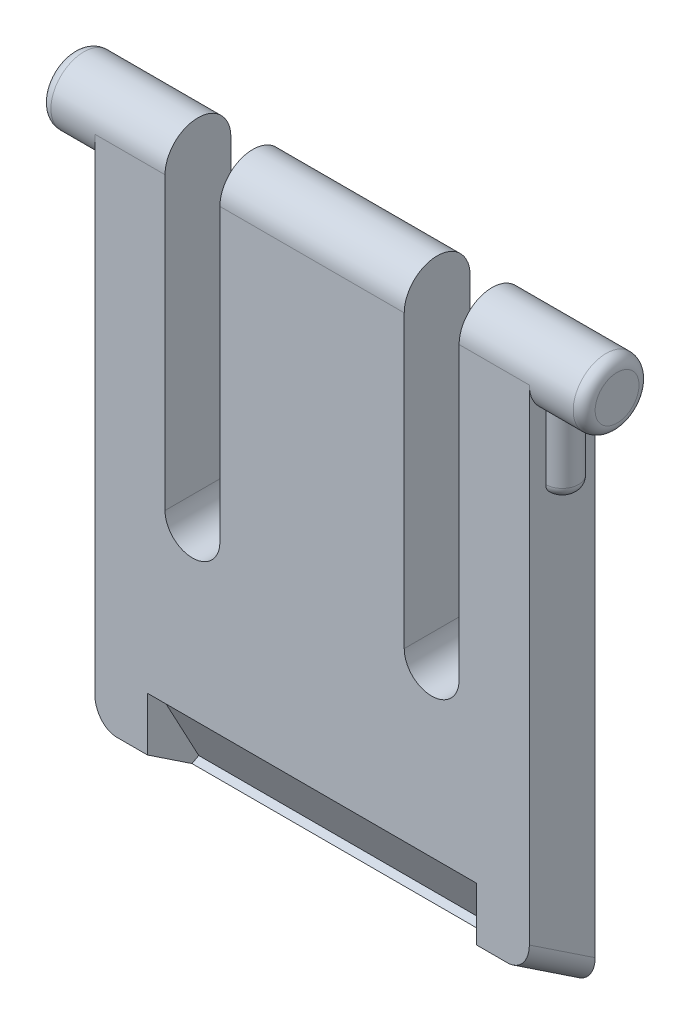
ISO-10303-21;
HEADER;
FILE_DESCRIPTION(('STEP AP214'),'2;1');
FILE_NAME('part.step','',(''),(''),'','','');
FILE_SCHEMA(('AUTOMOTIVE_DESIGN { 1 0 10303 214 1 1 1 1 }'));
ENDSEC;
DATA;
#1=APPLICATION_CONTEXT('core data for automotive mechanical design processes');
#2=APPLICATION_PROTOCOL_DEFINITION('international standard','automotive_design',2000,#1);
#3=PRODUCT_CONTEXT('',#1,'mechanical');
#4=PRODUCT('Part','Part','',(#3));
#5=PRODUCT_RELATED_PRODUCT_CATEGORY('part','',(#4));
#6=PRODUCT_DEFINITION_FORMATION('','',#4);
#7=PRODUCT_DEFINITION_CONTEXT('part definition',#1,'design');
#8=PRODUCT_DEFINITION('design','',#6,#7);
#9=PRODUCT_DEFINITION_SHAPE('','',#8);
#10=(LENGTH_UNIT() NAMED_UNIT(*) SI_UNIT(.MILLI.,.METRE.));
#11=(NAMED_UNIT(*) PLANE_ANGLE_UNIT() SI_UNIT($,.RADIAN.));
#12=(NAMED_UNIT(*) SI_UNIT($,.STERADIAN.) SOLID_ANGLE_UNIT());
#13=UNCERTAINTY_MEASURE_WITH_UNIT(LENGTH_MEASURE(1.E-05),#10,'distance_accuracy_value','');
#14=(GEOMETRIC_REPRESENTATION_CONTEXT(3) GLOBAL_UNCERTAINTY_ASSIGNED_CONTEXT((#13)) GLOBAL_UNIT_ASSIGNED_CONTEXT((#10,
#11,#12)) REPRESENTATION_CONTEXT('',''));
#15=CARTESIAN_POINT('',(0.,0.,0.));
#16=DIRECTION('',(0.,0.,1.));
#17=DIRECTION('',(1.,0.,0.));
#18=AXIS2_PLACEMENT_3D('',#15,#16,#17);
#19=CARTESIAN_POINT('',(4.45,12.05,3.));
#20=DIRECTION('',(0.,0.,1.));
#21=DIRECTION('',(1.,0.,0.));
#22=AXIS2_PLACEMENT_3D('',#19,#20,#21);
#23=PLANE('',#22);
#24=DIRECTION('',(-1.,0.,0.));
#25=VECTOR('',#24,1.);
#26=CARTESIAN_POINT('',(22.3,2.00000000000001,3.));
#27=LINE('',#26,#25);
#28=CARTESIAN_POINT('',(18.8,2.00000000000001,3.));
#29=VERTEX_POINT('',#28);
#30=CARTESIAN_POINT('',(17.4,2.00000000000001,3.));
#31=VERTEX_POINT('',#30);
#32=EDGE_CURVE('E238',#29,#31,#27,.T.);
#33=ORIENTED_EDGE('',*,*,#32,.F.);
#34=CARTESIAN_POINT('',(18.8,3.20185042515467,3.));
#35=DIRECTION('',(0.,0.,1.));
#36=DIRECTION('',(0.,-1.,0.));
#37=AXIS2_PLACEMENT_3D('',#34,#35,#36);
#38=ELLIPSE('',#37,1.20185042515466,1.);
#39=CARTESIAN_POINT('',(19.8,3.20185042515467,3.));
#40=VERTEX_POINT('',#39);
#41=EDGE_CURVE('E41',#29,#40,#38,.T.);
#42=ORIENTED_EDGE('',*,*,#41,.T.);
#43=DIRECTION('',(0.,1.,0.));
#44=VECTOR('',#43,1.);
#45=CARTESIAN_POINT('',(19.8,0.,3.));
#46=LINE('',#45,#44);
#47=CARTESIAN_POINT('',(19.8,25.3,3.));
#48=VERTEX_POINT('',#47);
#49=EDGE_CURVE('E632',#40,#48,#46,.T.);
#50=ORIENTED_EDGE('',*,*,#49,.T.);
#51=DIRECTION('',(-1.,0.,0.));
#52=VECTOR('',#51,1.);
#53=CARTESIAN_POINT('',(16.6,25.3,3.));
#54=LINE('',#53,#52);
#55=CARTESIAN_POINT('',(16.6,25.3,3.));
#56=VERTEX_POINT('',#55);
#57=EDGE_CURVE('E635',#48,#56,#54,.T.);
#58=ORIENTED_EDGE('',*,*,#57,.T.);
#59=DIRECTION('',(0.,-1.,0.));
#60=VECTOR('',#59,1.);
#61=CARTESIAN_POINT('',(16.6,25.3,3.));
#62=LINE('',#61,#60);
#63=CARTESIAN_POINT('',(16.6,12.05,3.));
#64=VERTEX_POINT('',#63);
#65=EDGE_CURVE('E638',#56,#64,#62,.T.);
#66=ORIENTED_EDGE('',*,*,#65,.T.);
#67=CARTESIAN_POINT('',(15.35,12.05,3.));
#68=DIRECTION('',(0.,0.,-1.));
#69=DIRECTION('',(-1.,0.,0.));
#70=AXIS2_PLACEMENT_3D('',#67,#68,#69);
#71=CIRCLE('',#70,1.25);
#72=CARTESIAN_POINT('',(14.1,12.05,3.));
#73=VERTEX_POINT('',#72);
#74=EDGE_CURVE('E640',#64,#73,#71,.T.);
#75=ORIENTED_EDGE('',*,*,#74,.T.);
#76=DIRECTION('',(0.,1.,0.));
#77=VECTOR('',#76,1.);
#78=CARTESIAN_POINT('',(14.1,25.3,3.));
#79=LINE('',#78,#77);
#80=CARTESIAN_POINT('',(14.1,25.3,3.));
#81=VERTEX_POINT('',#80);
#82=EDGE_CURVE('E642',#73,#81,#79,.T.);
#83=ORIENTED_EDGE('',*,*,#82,.T.);
#84=DIRECTION('',(-1.,0.,0.));
#85=VECTOR('',#84,1.);
#86=CARTESIAN_POINT('',(5.7,25.3,3.));
#87=LINE('',#86,#85);
#88=CARTESIAN_POINT('',(5.7,25.3,3.));
#89=VERTEX_POINT('',#88);
#90=EDGE_CURVE('E645',#81,#89,#87,.T.);
#91=ORIENTED_EDGE('',*,*,#90,.T.);
#92=DIRECTION('',(0.,-1.,0.));
#93=VECTOR('',#92,1.);
#94=CARTESIAN_POINT('',(5.7,25.3,3.));
#95=LINE('',#94,#93);
#96=CARTESIAN_POINT('',(5.7,12.05,3.));
#97=VERTEX_POINT('',#96);
#98=EDGE_CURVE('E648',#89,#97,#95,.T.);
#99=ORIENTED_EDGE('',*,*,#98,.T.);
#100=CARTESIAN_POINT('',(4.45,12.05,3.));
#101=DIRECTION('',(0.,0.,-1.));
#102=DIRECTION('',(1.,0.,0.));
#103=AXIS2_PLACEMENT_3D('',#100,#101,#102);
#104=CIRCLE('',#103,1.25);
#105=CARTESIAN_POINT('',(3.2,12.05,3.));
#106=VERTEX_POINT('',#105);
#107=EDGE_CURVE('E650',#97,#106,#104,.T.);
#108=ORIENTED_EDGE('',*,*,#107,.T.);
#109=DIRECTION('',(0.,1.,0.));
#110=VECTOR('',#109,1.);
#111=CARTESIAN_POINT('',(3.2,25.3,3.));
#112=LINE('',#111,#110);
#113=CARTESIAN_POINT('',(3.2,25.3,3.));
#114=VERTEX_POINT('',#113);
#115=EDGE_CURVE('E652',#106,#114,#112,.T.);
#116=ORIENTED_EDGE('',*,*,#115,.T.);
#117=DIRECTION('',(-1.,0.,0.));
#118=VECTOR('',#117,1.);
#119=CARTESIAN_POINT('',(0.,25.3,3.));
#120=LINE('',#119,#118);
#121=CARTESIAN_POINT('',(0.,25.3,3.));
#122=VERTEX_POINT('',#121);
#123=EDGE_CURVE('E655',#114,#122,#120,.T.);
#124=ORIENTED_EDGE('',*,*,#123,.T.);
#125=DIRECTION('',(0.,-1.,0.));
#126=VECTOR('',#125,1.);
#127=CARTESIAN_POINT('',(0.,0.,3.));
#128=LINE('',#127,#126);
#129=CARTESIAN_POINT('',(0.,3.20185042515467,3.));
#130=VERTEX_POINT('',#129);
#131=EDGE_CURVE('E630',#122,#130,#128,.T.);
#132=ORIENTED_EDGE('',*,*,#131,.T.);
#133=CARTESIAN_POINT('',(1.,3.20185042515467,3.));
#134=DIRECTION('',(0.,0.,1.));
#135=DIRECTION('',(0.,-1.,0.));
#136=AXIS2_PLACEMENT_3D('',#133,#134,#135);
#137=ELLIPSE('',#136,1.20185042515466,1.);
#138=CARTESIAN_POINT('',(1.,2.00000000000001,3.));
#139=VERTEX_POINT('',#138);
#140=EDGE_CURVE('E359',#130,#139,#137,.T.);
#141=ORIENTED_EDGE('',*,*,#140,.T.);
#142=CARTESIAN_POINT('',(2.40000000000001,2.00000000000001,3.));
#143=VERTEX_POINT('',#142);
#144=EDGE_CURVE('E237',#143,#139,#27,.T.);
#145=ORIENTED_EDGE('',*,*,#144,.F.);
#146=DIRECTION('',(0.,1.,0.));
#147=VECTOR('',#146,1.);
#148=CARTESIAN_POINT('',(2.40000000000001,12.05,3.));
#149=LINE('',#148,#147);
#150=CARTESIAN_POINT('',(2.40000000000001,4.43854215722194,3.));
#151=VERTEX_POINT('',#150);
#152=EDGE_CURVE('E225',#143,#151,#149,.T.);
#153=ORIENTED_EDGE('',*,*,#152,.T.);
#154=DIRECTION('',(1.,0.,0.));
#155=VECTOR('',#154,1.);
#156=CARTESIAN_POINT('',(4.45,4.43854215722194,3.));
#157=LINE('',#156,#155);
#158=CARTESIAN_POINT('',(17.4,4.43854215722194,3.));
#159=VERTEX_POINT('',#158);
#160=EDGE_CURVE('E382',#151,#159,#157,.T.);
#161=ORIENTED_EDGE('',*,*,#160,.T.);
#162=DIRECTION('',(0.,-1.,0.));
#163=VECTOR('',#162,1.);
#164=CARTESIAN_POINT('',(17.4,12.05,3.));
#165=LINE('',#164,#163);
#166=EDGE_CURVE('E229',#159,#31,#165,.T.);
#167=ORIENTED_EDGE('',*,*,#166,.T.);
#168=EDGE_LOOP('',(#33,#42,#50,#58,#66,#75,#83,#91,#99,#108,#116,#124,#132,#141,#145,#153,#161,#167));
#169=FACE_BOUND('',#168,.T.);
#170=ADVANCED_FACE('F33',(#169),#23,.T.);
#171=CARTESIAN_POINT('',(22.3,0.,0.));
#172=DIRECTION('',(0.,0.832050294337843,-0.55470019622523));
#173=DIRECTION('',(0.,0.55470019622523,0.832050294337843));
#174=AXIS2_PLACEMENT_3D('',#171,#172,#173);
#175=PLANE('',#174);
#176=DIRECTION('',(1.,0.,0.));
#177=VECTOR('',#176,1.);
#178=CARTESIAN_POINT('',(0.,0.,0.));
#179=LINE('',#178,#177);
#180=CARTESIAN_POINT('',(1.,0.,0.));
#181=VERTEX_POINT('',#180);
#182=CARTESIAN_POINT('',(18.8,0.,0.));
#183=VERTEX_POINT('',#182);
#184=EDGE_CURVE('E659',#181,#183,#179,.T.);
#185=ORIENTED_EDGE('',*,*,#184,.T.);
#186=DIRECTION('',(0.,-0.55470019622523,-0.832050294337843));
#187=VECTOR('',#186,1.);
#188=CARTESIAN_POINT('',(18.8,0.,0.));
#189=LINE('',#188,#187);
#190=EDGE_CURVE('E54',#183,#29,#189,.F.);
#191=ORIENTED_EDGE('',*,*,#190,.T.);
#192=ORIENTED_EDGE('',*,*,#32,.T.);
#193=DIRECTION('',(0.,0.55470019622523,0.832050294337843));
#194=VECTOR('',#193,1.);
#195=CARTESIAN_POINT('',(17.4,0.,0.));
#196=LINE('',#195,#194);
#197=CARTESIAN_POINT('',(17.4,0.647341040063493,0.971011560095235));
#198=VERTEX_POINT('',#197);
#199=EDGE_CURVE('E385',#198,#31,#196,.T.);
#200=ORIENTED_EDGE('',*,*,#199,.F.);
#201=DIRECTION('',(1.,0.,0.));
#202=VECTOR('',#201,1.);
#203=CARTESIAN_POINT('',(22.3,0.647341040063493,0.971011560095233));
#204=LINE('',#203,#202);
#205=CARTESIAN_POINT('',(2.40000000000001,0.647341040063494,0.971011560095237));
#206=VERTEX_POINT('',#205);
#207=EDGE_CURVE('E224',#206,#198,#204,.T.);
#208=ORIENTED_EDGE('',*,*,#207,.F.);
#209=DIRECTION('',(0.,-0.55470019622523,-0.832050294337843));
#210=VECTOR('',#209,1.);
#211=CARTESIAN_POINT('',(2.40000000000001,0.,0.));
#212=LINE('',#211,#210);
#213=EDGE_CURVE('E388',#143,#206,#212,.T.);
#214=ORIENTED_EDGE('',*,*,#213,.F.);
#215=ORIENTED_EDGE('',*,*,#144,.T.);
#216=DIRECTION('',(0.,-0.55470019622523,-0.832050294337843));
#217=VECTOR('',#216,1.);
#218=CARTESIAN_POINT('',(1.,0.,0.));
#219=LINE('',#218,#217);
#220=EDGE_CURVE('E363',#139,#181,#219,.T.);
#221=ORIENTED_EDGE('',*,*,#220,.T.);
#222=EDGE_LOOP('',(#185,#191,#192,#200,#208,#214,#215,#221));
#223=FACE_BOUND('',#222,.T.);
#224=ADVANCED_FACE('F292',(#223),#175,.F.);
#225=CARTESIAN_POINT('',(19.8,0.,3.));
#226=DIRECTION('',(-1.,0.,0.));
#227=DIRECTION('',(0.,-1.,0.));
#228=AXIS2_PLACEMENT_3D('',#225,#226,#227);
#229=PLANE('',#228);
#230=ORIENTED_EDGE('',*,*,#49,.F.);
#231=DIRECTION('',(0.,-0.55470019622523,-0.832050294337843));
#232=VECTOR('',#231,1.);
#233=CARTESIAN_POINT('',(19.8,2.21666567895323,1.52222288069784));
#234=LINE('',#233,#232);
#235=CARTESIAN_POINT('',(19.8,1.20185042515467,0.));
#236=VERTEX_POINT('',#235);
#237=EDGE_CURVE('E357',#40,#236,#234,.T.);
#238=ORIENTED_EDGE('',*,*,#237,.T.);
#239=DIRECTION('',(0.,1.,0.));
#240=VECTOR('',#239,1.);
#241=CARTESIAN_POINT('',(19.8,0.,0.));
#242=LINE('',#241,#240);
#243=CARTESIAN_POINT('',(19.8,25.3,0.));
#244=VERTEX_POINT('',#243);
#245=EDGE_CURVE('E620',#236,#244,#242,.T.);
#246=ORIENTED_EDGE('',*,*,#245,.T.);
#247=CARTESIAN_POINT('',(19.8,25.3,1.5));
#248=DIRECTION('',(-1.,0.,0.));
#249=DIRECTION('',(0.,-1.,0.));
#250=AXIS2_PLACEMENT_3D('',#247,#248,#249);
#251=CIRCLE('',#250,1.5);
#252=CARTESIAN_POINT('',(19.8,24.0009618943233,0.749999999999999));
#253=VERTEX_POINT('',#252);
#254=EDGE_CURVE('E262',#253,#244,#251,.F.);
#255=ORIENTED_EDGE('',*,*,#254,.F.);
#256=DIRECTION('',(0.,1.,0.));
#257=VECTOR('',#256,1.);
#258=CARTESIAN_POINT('',(19.8,20.5,0.75));
#259=LINE('',#258,#257);
#260=CARTESIAN_POINT('',(19.8,21.,0.75));
#261=VERTEX_POINT('',#260);
#262=EDGE_CURVE('E243',#261,#253,#259,.T.);
#263=ORIENTED_EDGE('',*,*,#262,.F.);
#264=CARTESIAN_POINT('',(19.8,21.,1.25));
#265=DIRECTION('',(-1.,0.,0.));
#266=DIRECTION('',(0.,-1.,0.));
#267=AXIS2_PLACEMENT_3D('',#264,#265,#266);
#268=CIRCLE('',#267,0.5);
#269=CARTESIAN_POINT('',(19.8,20.5,1.25));
#270=VERTEX_POINT('',#269);
#271=EDGE_CURVE('E390',#261,#270,#268,.T.);
#272=ORIENTED_EDGE('',*,*,#271,.T.);
#273=DIRECTION('',(0.,0.,-1.));
#274=VECTOR('',#273,1.);
#275=CARTESIAN_POINT('',(19.8,20.5,0.75));
#276=LINE('',#275,#274);
#277=CARTESIAN_POINT('',(19.8,20.5,1.75));
#278=VERTEX_POINT('',#277);
#279=EDGE_CURVE('E240',#278,#270,#276,.T.);
#280=ORIENTED_EDGE('',*,*,#279,.F.);
#281=CARTESIAN_POINT('',(19.8,21.,1.75));
#282=DIRECTION('',(-1.,0.,0.));
#283=DIRECTION('',(0.,-1.,0.));
#284=AXIS2_PLACEMENT_3D('',#281,#282,#283);
#285=CIRCLE('',#284,0.5);
#286=CARTESIAN_POINT('',(19.8,21.,2.25));
#287=VERTEX_POINT('',#286);
#288=EDGE_CURVE('E392',#278,#287,#285,.T.);
#289=ORIENTED_EDGE('',*,*,#288,.T.);
#290=DIRECTION('',(0.,1.,0.));
#291=VECTOR('',#290,1.);
#292=CARTESIAN_POINT('',(19.8,20.5,2.25));
#293=LINE('',#292,#291);
#294=CARTESIAN_POINT('',(19.8,24.0009618943233,2.25));
#295=VERTEX_POINT('',#294);
#296=EDGE_CURVE('E244',#287,#295,#293,.T.);
#297=ORIENTED_EDGE('',*,*,#296,.T.);
#298=EDGE_CURVE('E263',#48,#295,#251,.F.);
#299=ORIENTED_EDGE('',*,*,#298,.F.);
#300=EDGE_LOOP('',(#230,#238,#246,#255,#263,#272,#280,#289,#297,#299));
#301=FACE_BOUND('',#300,.T.);
#302=ADVANCED_FACE('F297',(#301),#229,.F.);
#303=CARTESIAN_POINT('',(22.3,25.3,1.5));
#304=DIRECTION('',(-1.,0.,0.));
#305=DIRECTION('',(0.,0.,1.));
#306=AXIS2_PLACEMENT_3D('',#303,#304,#305);
#307=CYLINDRICAL_SURFACE('',#306,1.5);
#308=CARTESIAN_POINT('',(21.8,25.3,1.5));
#309=DIRECTION('',(1.,0.,0.));
#310=DIRECTION('',(0.,0.,-1.));
#311=AXIS2_PLACEMENT_3D('',#308,#309,#310);
#312=CIRCLE('',#311,1.5);
#313=CARTESIAN_POINT('',(21.8,25.3,0.));
#314=VERTEX_POINT('',#313);
#315=EDGE_CURVE('E371',#314,#314,#312,.F.);
#316=ORIENTED_EDGE('',*,*,#315,.T.);
#317=EDGE_LOOP('',(#316));
#318=FACE_BOUND('',#317,.T.);
#319=CARTESIAN_POINT('',(19.8,24.0009618943233,0.75));
#320=CARTESIAN_POINT('',(19.819647032131,24.0009657946303,0.749998537277538));
#321=CARTESIAN_POINT('',(19.8392829009158,24.0005156229533,0.750772511062748));
#322=CARTESIAN_POINT('',(19.8783831215574,23.9987450023491,0.753849708069334));
#323=CARTESIAN_POINT('',(19.8978475713543,23.9974250881259,0.756151991716276));
#324=CARTESIAN_POINT('',(19.9555421016108,23.9922394704125,0.765280095620311));
#325=CARTESIAN_POINT('',(19.9933356081159,23.9871468821059,0.774327836759806));
#326=CARTESIAN_POINT('',(20.0665696865266,23.9743852093123,0.797916193490636));
#327=CARTESIAN_POINT('',(20.1020148718455,23.9667213674783,0.812445639615321));
#328=CARTESIAN_POINT('',(20.1700168743481,23.9496939659445,0.846519932815454));
#329=CARTESIAN_POINT('',(20.2025691099101,23.9403277791986,0.8660725511688));
#330=CARTESIAN_POINT('',(20.2667338083355,23.9200223165456,0.911502796976962));
#331=CARTESIAN_POINT('',(20.2980516557723,23.9090170338236,0.937766942584036));
#332=CARTESIAN_POINT('',(20.3560621519811,23.8872076674116,0.995066678258181));
#333=CARTESIAN_POINT('',(20.382753545921,23.8764036390148,1.02610355853875));
#334=CARTESIAN_POINT('',(20.4325253168907,23.8553389697962,1.09463268750468));
#335=CARTESIAN_POINT('',(20.4552401651487,23.8451642813503,1.1324193159056));
#336=CARTESIAN_POINT('',(20.4938555033626,23.8273693866895,1.21188191073645));
#337=CARTESIAN_POINT('',(20.509760241833,23.8197475884918,1.25355543249002));
#338=CARTESIAN_POINT('',(20.5331284077457,23.8083965854285,1.33646596559045));
#339=CARTESIAN_POINT('',(20.5411120156198,23.804428962884,1.37752298440767));
#340=CARTESIAN_POINT('',(20.5501245703662,23.7999431301916,1.46057134029847));
#341=CARTESIAN_POINT('',(20.5511576120121,23.7994228890973,1.50256211263849));
#342=CARTESIAN_POINT('',(20.5464399736965,23.8017776463205,1.58237475777054));
#343=CARTESIAN_POINT('',(20.5412713907683,23.8043613304517,1.62024162375806));
#344=CARTESIAN_POINT('',(20.5253391596954,23.8121932608298,1.69448602568525));
#345=CARTESIAN_POINT('',(20.5145751995883,23.8174416556435,1.73086347846277));
#346=CARTESIAN_POINT('',(20.4876881819577,23.8302130771322,1.80173177781162));
#347=CARTESIAN_POINT('',(20.4714930284292,23.8377665743086,1.83618955273745));
#348=CARTESIAN_POINT('',(20.4343027261708,23.854467521541,1.90198214023004));
#349=CARTESIAN_POINT('',(20.4133057881393,23.8636155654743,1.93331578237717));
#350=CARTESIAN_POINT('',(20.3648302197267,23.8836663556067,1.99512813947237));
#351=CARTESIAN_POINT('',(20.336926706932,23.8946532255003,2.025246595793));
#352=CARTESIAN_POINT('',(20.2765615645412,23.9165910524693,2.0805750561311));
#353=CARTESIAN_POINT('',(20.2440958764046,23.9275419685848,2.10578064144198));
#354=CARTESIAN_POINT('',(20.1729902046969,23.9489262580288,2.15214514233255));
#355=CARTESIAN_POINT('',(20.1340877185555,23.9592813415533,2.17294064665796));
#356=CARTESIAN_POINT('',(20.0527327594589,23.9771950117104,2.20750919486814));
#357=CARTESIAN_POINT('',(20.0102890784722,23.9847602855102,2.22129906164039));
#358=CARTESIAN_POINT('',(19.9395668135394,23.9937639532823,2.23742708763122));
#359=CARTESIAN_POINT('',(19.9119652678863,23.9964365697797,2.24212169057584));
#360=CARTESIAN_POINT('',(19.8562526490288,24.0000471118003,2.24841604721896));
#361=CARTESIAN_POINT('',(19.8281407643145,24.0009819749743,2.25001033763107));
#362=CARTESIAN_POINT('',(19.8,24.0009618943233,2.25));
#363=B_SPLINE_CURVE_WITH_KNOTS('',3,(#319,#320,#321,#322,#323,#324,#325,#326,#327,#328,#329,
#330,#331,#332,#333,#334,#335,#336,#337,#338,#339,#340,#341,#342,#343,#344,#345,#346,#347,#348,
#349,#350,#351,#352,#353,#354,#355,#356,#357,#358,#359,#360,#361,#362),.UNSPECIFIED.,.F.,.F.,(4,
2,2,2,2,2,2,2,2,2,2,2,2,2,2,2,2,2,2,2,2,4),(0.,0.0588994666505113,0.117762756576717,
0.234713894174611,0.351428009137797,0.468323789778093,0.594780286903887,0.721271029309257,
0.856302920455093,0.991250448237455,1.11659436092991,1.24186442353628,1.35624106776995,
1.47062408959741,1.58658989867301,1.70259899100822,1.82956496263752,1.95664460760282,
2.09187799659614,2.22678509137946,2.31094739049864,2.39525786421683),.UNSPECIFIED.);
#364=EDGE_CURVE('E399',#253,#295,#363,.T.);
#365=ORIENTED_EDGE('',*,*,#364,.F.);
#366=ORIENTED_EDGE('',*,*,#254,.T.);
#367=DIRECTION('',(-1.,0.,0.));
#368=VECTOR('',#367,1.);
#369=CARTESIAN_POINT('',(16.6,25.3,0.));
#370=LINE('',#369,#368);
#371=CARTESIAN_POINT('',(16.6,25.3,0.));
#372=VERTEX_POINT('',#371);
#373=EDGE_CURVE('E662',#244,#372,#370,.T.);
#374=ORIENTED_EDGE('',*,*,#373,.T.);
#375=CARTESIAN_POINT('',(16.6,25.3,1.5));
#376=DIRECTION('',(1.,0.,0.));
#377=DIRECTION('',(0.,0.,-1.));
#378=AXIS2_PLACEMENT_3D('',#375,#376,#377);
#379=CIRCLE('',#378,1.5);
#380=EDGE_CURVE('E698',#372,#56,#379,.T.);
#381=ORIENTED_EDGE('',*,*,#380,.T.);
#382=ORIENTED_EDGE('',*,*,#57,.F.);
#383=ORIENTED_EDGE('',*,*,#298,.T.);
#384=EDGE_LOOP('',(#365,#366,#374,#381,#382,#383));
#385=FACE_BOUND('',#384,.T.);
#386=ADVANCED_FACE('F265',(#318,#385),#307,.T.);
#387=ORIENTED_EDGE('',*,*,#90,.F.);
#388=CARTESIAN_POINT('',(14.1,25.3,1.5));
#389=DIRECTION('',(-1.,0.,0.));
#390=DIRECTION('',(0.,0.,1.));
#391=AXIS2_PLACEMENT_3D('',#388,#389,#390);
#392=CIRCLE('',#391,1.5);
#393=CARTESIAN_POINT('',(14.1,25.3,0.));
#394=VERTEX_POINT('',#393);
#395=EDGE_CURVE('E700',#81,#394,#392,.T.);
#396=ORIENTED_EDGE('',*,*,#395,.T.);
#397=DIRECTION('',(-1.,0.,0.));
#398=VECTOR('',#397,1.);
#399=CARTESIAN_POINT('',(5.7,25.3,0.));
#400=LINE('',#399,#398);
#401=CARTESIAN_POINT('',(5.7,25.3,0.));
#402=VERTEX_POINT('',#401);
#403=EDGE_CURVE('E671',#394,#402,#400,.T.);
#404=ORIENTED_EDGE('',*,*,#403,.T.);
#405=CARTESIAN_POINT('',(5.7,25.3,1.5));
#406=DIRECTION('',(1.,0.,0.));
#407=DIRECTION('',(0.,0.,-1.));
#408=AXIS2_PLACEMENT_3D('',#405,#406,#407);
#409=CIRCLE('',#408,1.5);
#410=EDGE_CURVE('E694',#402,#89,#409,.T.);
#411=ORIENTED_EDGE('',*,*,#410,.T.);
#412=EDGE_LOOP('',(#387,#396,#404,#411));
#413=FACE_BOUND('',#412,.T.);
#414=ADVANCED_FACE('F521',(#413),#307,.T.);
#415=CARTESIAN_POINT('',(-1.99999999999999,25.3,1.5));
#416=DIRECTION('',(1.,0.,0.));
#417=DIRECTION('',(0.,0.,-1.));
#418=AXIS2_PLACEMENT_3D('',#415,#416,#417);
#419=CIRCLE('',#418,1.5);
#420=CARTESIAN_POINT('',(-1.99999999999999,25.3,0.));
#421=VERTEX_POINT('',#420);
#422=EDGE_CURVE('E379',#421,#421,#419,.T.);
#423=ORIENTED_EDGE('',*,*,#422,.T.);
#424=EDGE_LOOP('',(#423));
#425=FACE_BOUND('',#424,.T.);
#426=CARTESIAN_POINT('',(0.,25.3,1.5));
#427=DIRECTION('',(1.,0.,0.));
#428=DIRECTION('',(0.,1.,0.));
#429=AXIS2_PLACEMENT_3D('',#426,#427,#428);
#430=CIRCLE('',#429,1.5);
#431=CARTESIAN_POINT('',(0.,25.3,0.));
#432=VERTEX_POINT('',#431);
#433=CARTESIAN_POINT('',(0.,24.0009618943233,0.75));
#434=VERTEX_POINT('',#433);
#435=EDGE_CURVE('E622',#432,#434,#430,.F.);
#436=ORIENTED_EDGE('',*,*,#435,.T.);
#437=CARTESIAN_POINT('',(0.,24.0009618943233,0.75));
#438=CARTESIAN_POINT('',(-0.0196470321310446,24.0009657946303,0.749998537277538));
#439=CARTESIAN_POINT('',(-0.0392829009157672,24.0005156229533,0.750772511062748));
#440=CARTESIAN_POINT('',(-0.0783831215574329,23.9987450023491,0.753849708069334));
#441=CARTESIAN_POINT('',(-0.097847571354287,23.9974250881259,0.756151991716276));
#442=CARTESIAN_POINT('',(-0.155542101610823,23.9922394704125,0.765280095620311));
#443=CARTESIAN_POINT('',(-0.193335608115899,23.9871468821059,0.774327836759806));
#444=CARTESIAN_POINT('',(-0.266569686526625,23.9743852093123,0.797916193490638));
#445=CARTESIAN_POINT('',(-0.302014871845458,23.9667213674783,0.812445639615323));
#446=CARTESIAN_POINT('',(-0.37001687434808,23.9496939659444,0.846519932815458));
#447=CARTESIAN_POINT('',(-0.402569109910052,23.9403277791986,0.866072551168803));
#448=CARTESIAN_POINT('',(-0.466733808335468,23.9200223165456,0.911502796976966));
#449=CARTESIAN_POINT('',(-0.498051655772341,23.9090170338236,0.937766942584039));
#450=CARTESIAN_POINT('',(-0.556062151981089,23.8872076674116,0.995066678258184));
#451=CARTESIAN_POINT('',(-0.58275354592097,23.8764036390148,1.02610355853875));
#452=CARTESIAN_POINT('',(-0.632525316890727,23.8553389697962,1.09463268750468));
#453=CARTESIAN_POINT('',(-0.65524016514872,23.8451642813503,1.1324193159056));
#454=CARTESIAN_POINT('',(-0.693855503362614,23.8273693866895,1.21188191073645));
#455=CARTESIAN_POINT('',(-0.709760241833005,23.8197475884918,1.25355543249002));
#456=CARTESIAN_POINT('',(-0.733128407745677,23.8083965854285,1.33646596559045));
#457=CARTESIAN_POINT('',(-0.741112015619763,23.804428962884,1.37752298440767));
#458=CARTESIAN_POINT('',(-0.750124570366173,23.7999431301916,1.46057134029847));
#459=CARTESIAN_POINT('',(-0.751157612012052,23.7994228890973,1.50256211263849));
#460=CARTESIAN_POINT('',(-0.746439973696446,23.8017776463204,1.58237475777055));
#461=CARTESIAN_POINT('',(-0.741271390768296,23.8043613304517,1.62024162375806));
#462=CARTESIAN_POINT('',(-0.725339159695405,23.8121932608298,1.69448602568525));
#463=CARTESIAN_POINT('',(-0.714575199588241,23.8174416556435,1.73086347846277));
#464=CARTESIAN_POINT('',(-0.687688181957742,23.8302130771322,1.80173177781162));
#465=CARTESIAN_POINT('',(-0.671493028429211,23.8377665743086,1.83618955273746));
#466=CARTESIAN_POINT('',(-0.634302726170759,23.854467521541,1.90198214023005));
#467=CARTESIAN_POINT('',(-0.61330578813927,23.8636155654743,1.93331578237717));
#468=CARTESIAN_POINT('',(-0.564830219726681,23.8836663556067,1.99512813947237));
#469=CARTESIAN_POINT('',(-0.536926706932009,23.8946532255003,2.025246595793));
#470=CARTESIAN_POINT('',(-0.476561564541225,23.9165910524693,2.0805750561311));
#471=CARTESIAN_POINT('',(-0.444095876404628,23.9275419685848,2.10578064144198));
#472=CARTESIAN_POINT('',(-0.372990204696894,23.9489262580288,2.15214514233255));
#473=CARTESIAN_POINT('',(-0.334087718555499,23.9592813415533,2.17294064665796));
#474=CARTESIAN_POINT('',(-0.252732759458918,23.9771950117104,2.20750919486814));
#475=CARTESIAN_POINT('',(-0.210289078472158,23.9847602855102,2.22129906164039));
#476=CARTESIAN_POINT('',(-0.139566813539427,23.9937639532823,2.23742708763122));
#477=CARTESIAN_POINT('',(-0.11196526788632,23.9964365697797,2.24212169057584));
#478=CARTESIAN_POINT('',(-0.0562526490287537,24.0000471118003,2.24841604721896));
#479=CARTESIAN_POINT('',(-0.0281407643145079,24.0009819749743,2.25001033763107));
#480=CARTESIAN_POINT('',(0.,24.0009618943233,2.25));
#481=B_SPLINE_CURVE_WITH_KNOTS('',3,(#437,#438,#439,#440,#441,#442,#443,#444,#445,#446,#447,
#448,#449,#450,#451,#452,#453,#454,#455,#456,#457,#458,#459,#460,#461,#462,#463,#464,#465,#466,
#467,#468,#469,#470,#471,#472,#473,#474,#475,#476,#477,#478,#479,#480),.UNSPECIFIED.,.F.,.F.,(4,
2,2,2,2,2,2,2,2,2,2,2,2,2,2,2,2,2,2,2,2,4),(0.,0.0588994666505152,0.117762756576718,
0.234713894174614,0.351428009137806,0.468323789778101,0.594780286903894,0.721271029309258,
0.856302920455095,0.991250448237458,1.11659436092991,1.24186442353628,1.35624106776995,
1.47062408959741,1.58658989867302,1.70259899100823,1.82956496263753,1.95664460760282,
2.09187799659615,2.22678509137946,2.31094739049864,2.39525786421683),.UNSPECIFIED.);
#482=CARTESIAN_POINT('',(0.,24.0009618943233,2.25));
#483=VERTEX_POINT('',#482);
#484=EDGE_CURVE('E253',#434,#483,#481,.T.);
#485=ORIENTED_EDGE('',*,*,#484,.T.);
#486=EDGE_CURVE('E621',#483,#122,#430,.F.);
#487=ORIENTED_EDGE('',*,*,#486,.T.);
#488=ORIENTED_EDGE('',*,*,#123,.F.);
#489=CARTESIAN_POINT('',(3.2,25.3,1.5));
#490=DIRECTION('',(-1.,0.,0.));
#491=DIRECTION('',(0.,0.,1.));
#492=AXIS2_PLACEMENT_3D('',#489,#490,#491);
#493=CIRCLE('',#492,1.5);
#494=CARTESIAN_POINT('',(3.2,25.3,0.));
#495=VERTEX_POINT('',#494);
#496=EDGE_CURVE('E696',#114,#495,#493,.T.);
#497=ORIENTED_EDGE('',*,*,#496,.T.);
#498=DIRECTION('',(-1.,0.,0.));
#499=VECTOR('',#498,1.);
#500=CARTESIAN_POINT('',(0.,25.3,0.));
#501=LINE('',#500,#499);
#502=EDGE_CURVE('E633',#495,#432,#501,.T.);
#503=ORIENTED_EDGE('',*,*,#502,.T.);
#504=EDGE_LOOP('',(#436,#485,#487,#488,#497,#503));
#505=FACE_BOUND('',#504,.T.);
#506=ADVANCED_FACE('F329',(#425,#505),#307,.T.);
#507=CARTESIAN_POINT('',(0.,0.,3.));
#508=DIRECTION('',(1.,0.,0.));
#509=DIRECTION('',(0.,1.,0.));
#510=AXIS2_PLACEMENT_3D('',#507,#508,#509);
#511=PLANE('',#510);
#512=DIRECTION('',(0.,-1.,0.));
#513=VECTOR('',#512,1.);
#514=CARTESIAN_POINT('',(0.,0.,0.));
#515=LINE('',#514,#513);
#516=CARTESIAN_POINT('',(0.,1.20185042515466,0.));
#517=VERTEX_POINT('',#516);
#518=EDGE_CURVE('E628',#432,#517,#515,.T.);
#519=ORIENTED_EDGE('',*,*,#518,.T.);
#520=DIRECTION('',(0.,-0.55470019622523,-0.832050294337843));
#521=VECTOR('',#520,1.);
#522=CARTESIAN_POINT('',(0.,2.21666567895323,1.52222288069784));
#523=LINE('',#522,#521);
#524=EDGE_CURVE('E11',#517,#130,#523,.F.);
#525=ORIENTED_EDGE('',*,*,#524,.T.);
#526=ORIENTED_EDGE('',*,*,#131,.F.);
#527=ORIENTED_EDGE('',*,*,#486,.F.);
#528=DIRECTION('',(0.,1.,0.));
#529=VECTOR('',#528,1.);
#530=CARTESIAN_POINT('',(0.,20.5,2.25));
#531=LINE('',#530,#529);
#532=CARTESIAN_POINT('',(0.,21.,2.25));
#533=VERTEX_POINT('',#532);
#534=EDGE_CURVE('E250',#533,#483,#531,.T.);
#535=ORIENTED_EDGE('',*,*,#534,.F.);
#536=CARTESIAN_POINT('',(0.,21.,1.75));
#537=DIRECTION('',(1.,0.,0.));
#538=DIRECTION('',(0.,1.,0.));
#539=AXIS2_PLACEMENT_3D('',#536,#537,#538);
#540=CIRCLE('',#539,0.5);
#541=CARTESIAN_POINT('',(0.,20.5,1.75));
#542=VERTEX_POINT('',#541);
#543=EDGE_CURVE('E706',#533,#542,#540,.T.);
#544=ORIENTED_EDGE('',*,*,#543,.T.);
#545=DIRECTION('',(0.,0.,-1.));
#546=VECTOR('',#545,1.);
#547=CARTESIAN_POINT('',(0.,20.5,0.75));
#548=LINE('',#547,#546);
#549=CARTESIAN_POINT('',(0.,20.5,1.25));
#550=VERTEX_POINT('',#549);
#551=EDGE_CURVE('E246',#542,#550,#548,.T.);
#552=ORIENTED_EDGE('',*,*,#551,.T.);
#553=CARTESIAN_POINT('',(0.,21.,1.25));
#554=DIRECTION('',(1.,0.,0.));
#555=DIRECTION('',(0.,1.,0.));
#556=AXIS2_PLACEMENT_3D('',#553,#554,#555);
#557=CIRCLE('',#556,0.5);
#558=CARTESIAN_POINT('',(0.,21.,0.75));
#559=VERTEX_POINT('',#558);
#560=EDGE_CURVE('E405',#550,#559,#557,.T.);
#561=ORIENTED_EDGE('',*,*,#560,.T.);
#562=DIRECTION('',(0.,1.,0.));
#563=VECTOR('',#562,1.);
#564=CARTESIAN_POINT('',(0.,20.5,0.75));
#565=LINE('',#564,#563);
#566=EDGE_CURVE('E251',#559,#434,#565,.T.);
#567=ORIENTED_EDGE('',*,*,#566,.T.);
#568=ORIENTED_EDGE('',*,*,#435,.F.);
#569=EDGE_LOOP('',(#519,#525,#526,#527,#535,#544,#552,#561,#567,#568));
#570=FACE_BOUND('',#569,.T.);
#571=ADVANCED_FACE('F322',(#570),#511,.F.);
#572=CARTESIAN_POINT('',(16.6,25.3,3.));
#573=DIRECTION('',(1.,0.,0.));
#574=DIRECTION('',(0.,0.,-1.));
#575=AXIS2_PLACEMENT_3D('',#572,#573,#574);
#576=PLANE('',#575);
#577=ORIENTED_EDGE('',*,*,#65,.F.);
#578=ORIENTED_EDGE('',*,*,#380,.F.);
#579=DIRECTION('',(0.,-1.,0.));
#580=VECTOR('',#579,1.);
#581=CARTESIAN_POINT('',(16.6,25.3,0.));
#582=LINE('',#581,#580);
#583=CARTESIAN_POINT('',(16.6,12.05,0.));
#584=VERTEX_POINT('',#583);
#585=EDGE_CURVE('E664',#372,#584,#582,.T.);
#586=ORIENTED_EDGE('',*,*,#585,.T.);
#587=DIRECTION('',(0.,0.,-1.));
#588=VECTOR('',#587,1.);
#589=CARTESIAN_POINT('',(16.6,12.05,3.));
#590=LINE('',#589,#588);
#591=EDGE_CURVE('E691',#64,#584,#590,.T.);
#592=ORIENTED_EDGE('',*,*,#591,.F.);
#593=EDGE_LOOP('',(#577,#578,#586,#592));
#594=FACE_BOUND('',#593,.T.);
#595=ADVANCED_FACE('F318',(#594),#576,.F.);
#596=CARTESIAN_POINT('',(15.35,12.05,3.));
#597=DIRECTION('',(0.,0.,-1.));
#598=DIRECTION('',(-1.,0.,0.));
#599=AXIS2_PLACEMENT_3D('',#596,#597,#598);
#600=CYLINDRICAL_SURFACE('',#599,1.25);
#601=CARTESIAN_POINT('',(15.35,12.05,0.));
#602=DIRECTION('',(0.,0.,-1.));
#603=DIRECTION('',(-1.,0.,0.));
#604=AXIS2_PLACEMENT_3D('',#601,#602,#603);
#605=CIRCLE('',#604,1.25);
#606=CARTESIAN_POINT('',(14.1,12.05,0.));
#607=VERTEX_POINT('',#606);
#608=EDGE_CURVE('E666',#584,#607,#605,.T.);
#609=ORIENTED_EDGE('',*,*,#608,.T.);
#610=DIRECTION('',(0.,0.,-1.));
#611=VECTOR('',#610,1.);
#612=CARTESIAN_POINT('',(14.1,12.05,3.));
#613=LINE('',#612,#611);
#614=EDGE_CURVE('E688',#73,#607,#613,.T.);
#615=ORIENTED_EDGE('',*,*,#614,.F.);
#616=ORIENTED_EDGE('',*,*,#74,.F.);
#617=ORIENTED_EDGE('',*,*,#591,.T.);
#618=EDGE_LOOP('',(#609,#615,#616,#617));
#619=FACE_BOUND('',#618,.T.);
#620=ADVANCED_FACE('F314',(#619),#600,.F.);
#621=CARTESIAN_POINT('',(14.1,25.3,3.));
#622=DIRECTION('',(-1.,0.,0.));
#623=DIRECTION('',(0.,-1.,0.));
#624=AXIS2_PLACEMENT_3D('',#621,#622,#623);
#625=PLANE('',#624);
#626=DIRECTION('',(0.,1.,0.));
#627=VECTOR('',#626,1.);
#628=CARTESIAN_POINT('',(14.1,25.3,0.));
#629=LINE('',#628,#627);
#630=EDGE_CURVE('E668',#607,#394,#629,.T.);
#631=ORIENTED_EDGE('',*,*,#630,.T.);
#632=ORIENTED_EDGE('',*,*,#395,.F.);
#633=ORIENTED_EDGE('',*,*,#82,.F.);
#634=ORIENTED_EDGE('',*,*,#614,.T.);
#635=EDGE_LOOP('',(#631,#632,#633,#634));
#636=FACE_BOUND('',#635,.T.);
#637=ADVANCED_FACE('F310',(#636),#625,.F.);
#638=CARTESIAN_POINT('',(5.7,25.3,3.));
#639=DIRECTION('',(1.,0.,0.));
#640=DIRECTION('',(0.,1.,0.));
#641=AXIS2_PLACEMENT_3D('',#638,#639,#640);
#642=PLANE('',#641);
#643=ORIENTED_EDGE('',*,*,#98,.F.);
#644=ORIENTED_EDGE('',*,*,#410,.F.);
#645=DIRECTION('',(0.,-1.,0.));
#646=VECTOR('',#645,1.);
#647=CARTESIAN_POINT('',(5.7,25.3,0.));
#648=LINE('',#647,#646);
#649=CARTESIAN_POINT('',(5.7,12.05,0.));
#650=VERTEX_POINT('',#649);
#651=EDGE_CURVE('E674',#402,#650,#648,.T.);
#652=ORIENTED_EDGE('',*,*,#651,.T.);
#653=DIRECTION('',(0.,0.,-1.));
#654=VECTOR('',#653,1.);
#655=CARTESIAN_POINT('',(5.7,12.05,3.));
#656=LINE('',#655,#654);
#657=EDGE_CURVE('E685',#97,#650,#656,.T.);
#658=ORIENTED_EDGE('',*,*,#657,.F.);
#659=EDGE_LOOP('',(#643,#644,#652,#658));
#660=FACE_BOUND('',#659,.T.);
#661=ADVANCED_FACE('F306',(#660),#642,.F.);
#662=CARTESIAN_POINT('',(4.45,12.05,3.));
#663=DIRECTION('',(0.,0.,-1.));
#664=DIRECTION('',(-1.,0.,0.));
#665=AXIS2_PLACEMENT_3D('',#662,#663,#664);
#666=CYLINDRICAL_SURFACE('',#665,1.25);
#667=CARTESIAN_POINT('',(4.45,12.05,0.));
#668=DIRECTION('',(0.,0.,-1.));
#669=DIRECTION('',(1.,0.,0.));
#670=AXIS2_PLACEMENT_3D('',#667,#668,#669);
#671=CIRCLE('',#670,1.25);
#672=CARTESIAN_POINT('',(3.2,12.05,0.));
#673=VERTEX_POINT('',#672);
#674=EDGE_CURVE('E676',#650,#673,#671,.T.);
#675=ORIENTED_EDGE('',*,*,#674,.T.);
#676=DIRECTION('',(0.,0.,-1.));
#677=VECTOR('',#676,1.);
#678=CARTESIAN_POINT('',(3.2,12.05,3.));
#679=LINE('',#678,#677);
#680=EDGE_CURVE('E657',#106,#673,#679,.T.);
#681=ORIENTED_EDGE('',*,*,#680,.F.);
#682=ORIENTED_EDGE('',*,*,#107,.F.);
#683=ORIENTED_EDGE('',*,*,#657,.T.);
#684=EDGE_LOOP('',(#675,#681,#682,#683));
#685=FACE_BOUND('',#684,.T.);
#686=ADVANCED_FACE('F302',(#685),#666,.F.);
#687=CARTESIAN_POINT('',(3.2,25.3,3.));
#688=DIRECTION('',(-1.,0.,0.));
#689=DIRECTION('',(0.,-1.,0.));
#690=AXIS2_PLACEMENT_3D('',#687,#688,#689);
#691=PLANE('',#690);
#692=DIRECTION('',(0.,1.,0.));
#693=VECTOR('',#692,1.);
#694=CARTESIAN_POINT('',(3.2,25.3,0.));
#695=LINE('',#694,#693);
#696=EDGE_CURVE('E678',#673,#495,#695,.T.);
#697=ORIENTED_EDGE('',*,*,#696,.T.);
#698=ORIENTED_EDGE('',*,*,#496,.F.);
#699=ORIENTED_EDGE('',*,*,#115,.F.);
#700=ORIENTED_EDGE('',*,*,#680,.T.);
#701=EDGE_LOOP('',(#697,#698,#699,#700));
#702=FACE_BOUND('',#701,.T.);
#703=ADVANCED_FACE('F287',(#702),#691,.F.);
#704=CARTESIAN_POINT('',(4.45,12.05,0.));
#705=DIRECTION('',(0.,0.,1.));
#706=DIRECTION('',(1.,0.,0.));
#707=AXIS2_PLACEMENT_3D('',#704,#705,#706);
#708=PLANE('',#707);
#709=ORIENTED_EDGE('',*,*,#245,.F.);
#710=CARTESIAN_POINT('',(18.8,1.20185042515467,0.));
#711=DIRECTION('',(0.,0.,1.));
#712=DIRECTION('',(0.,-1.,0.));
#713=AXIS2_PLACEMENT_3D('',#710,#711,#712);
#714=ELLIPSE('',#713,1.20185042515466,1.);
#715=EDGE_CURVE('E366',#236,#183,#714,.F.);
#716=ORIENTED_EDGE('',*,*,#715,.T.);
#717=ORIENTED_EDGE('',*,*,#184,.F.);
#718=CARTESIAN_POINT('',(1.,1.20185042515466,0.));
#719=DIRECTION('',(0.,0.,1.));
#720=DIRECTION('',(0.,-1.,0.));
#721=AXIS2_PLACEMENT_3D('',#718,#719,#720);
#722=ELLIPSE('',#721,1.20185042515466,1.);
#723=EDGE_CURVE('E368',#181,#517,#722,.F.);
#724=ORIENTED_EDGE('',*,*,#723,.T.);
#725=ORIENTED_EDGE('',*,*,#518,.F.);
#726=ORIENTED_EDGE('',*,*,#502,.F.);
#727=ORIENTED_EDGE('',*,*,#696,.F.);
#728=ORIENTED_EDGE('',*,*,#674,.F.);
#729=ORIENTED_EDGE('',*,*,#651,.F.);
#730=ORIENTED_EDGE('',*,*,#403,.F.);
#731=ORIENTED_EDGE('',*,*,#630,.F.);
#732=ORIENTED_EDGE('',*,*,#608,.F.);
#733=ORIENTED_EDGE('',*,*,#585,.F.);
#734=ORIENTED_EDGE('',*,*,#373,.F.);
#735=EDGE_LOOP('',(#709,#716,#717,#724,#725,#726,#727,#728,#729,#730,#731,#732,#733,#734));
#736=FACE_BOUND('',#735,.T.);
#737=ADVANCED_FACE('F282',(#736),#708,.F.);
#738=CARTESIAN_POINT('',(22.3,25.3,1.5));
#739=DIRECTION('',(1.,0.,0.));
#740=DIRECTION('',(0.,0.,-1.));
#741=AXIS2_PLACEMENT_3D('',#738,#739,#740);
#742=PLANE('',#741);
#743=CARTESIAN_POINT('',(22.3,25.3,1.5));
#744=DIRECTION('',(1.,0.,0.));
#745=DIRECTION('',(0.,0.,-1.));
#746=AXIS2_PLACEMENT_3D('',#743,#744,#745);
#747=CIRCLE('',#746,1.);
#748=CARTESIAN_POINT('',(22.3,25.3,0.499999999999999));
#749=VERTEX_POINT('',#748);
#750=EDGE_CURVE('E374',#749,#749,#747,.T.);
#751=ORIENTED_EDGE('',*,*,#750,.T.);
#752=EDGE_LOOP('',(#751));
#753=FACE_BOUND('',#752,.T.);
#754=ADVANCED_FACE('F279',(#753),#742,.T.);
#755=CARTESIAN_POINT('',(-2.49999999999999,25.3,1.5));
#756=DIRECTION('',(1.,0.,0.));
#757=DIRECTION('',(0.,0.,-1.));
#758=AXIS2_PLACEMENT_3D('',#755,#756,#757);
#759=PLANE('',#758);
#760=CARTESIAN_POINT('',(-2.49999999999999,25.3,1.5));
#761=DIRECTION('',(1.,0.,0.));
#762=DIRECTION('',(0.,0.,-1.));
#763=AXIS2_PLACEMENT_3D('',#760,#761,#762);
#764=CIRCLE('',#763,1.);
#765=CARTESIAN_POINT('',(-2.49999999999999,25.3,0.499999999999999));
#766=VERTEX_POINT('',#765);
#767=EDGE_CURVE('E376',#766,#766,#764,.F.);
#768=ORIENTED_EDGE('',*,*,#767,.T.);
#769=EDGE_LOOP('',(#768));
#770=FACE_BOUND('',#769,.T.);
#771=ADVANCED_FACE('F275',(#770),#759,.F.);
#772=CARTESIAN_POINT('',(0.,20.5,1.5));
#773=DIRECTION('',(0.,1.,0.));
#774=DIRECTION('',(0.,0.,1.));
#775=AXIS2_PLACEMENT_3D('',#772,#773,#774);
#776=CYLINDRICAL_SURFACE('',#775,0.75);
#777=ORIENTED_EDGE('',*,*,#566,.F.);
#778=CARTESIAN_POINT('',(0.,21.,1.5));
#779=DIRECTION('',(0.,1.,0.));
#780=DIRECTION('',(0.,0.,1.));
#781=AXIS2_PLACEMENT_3D('',#778,#779,#780);
#782=CIRCLE('',#781,0.75);
#783=EDGE_CURVE('E702',#559,#533,#782,.T.);
#784=ORIENTED_EDGE('',*,*,#783,.T.);
#785=ORIENTED_EDGE('',*,*,#534,.T.);
#786=ORIENTED_EDGE('',*,*,#484,.F.);
#787=EDGE_LOOP('',(#777,#784,#785,#786));
#788=FACE_BOUND('',#787,.T.);
#789=ADVANCED_FACE('F269',(#788),#776,.T.);
#790=CARTESIAN_POINT('',(0.,20.5,1.5));
#791=DIRECTION('',(0.,1.,0.));
#792=DIRECTION('',(0.,0.,1.));
#793=AXIS2_PLACEMENT_3D('',#790,#791,#792);
#794=PLANE('',#793);
#795=ORIENTED_EDGE('',*,*,#551,.F.);
#796=CARTESIAN_POINT('',(0.,20.5,1.5));
#797=DIRECTION('',(0.,1.,0.));
#798=DIRECTION('',(0.,0.,1.));
#799=AXIS2_PLACEMENT_3D('',#796,#797,#798);
#800=CIRCLE('',#799,0.25);
#801=EDGE_CURVE('E705',#542,#550,#800,.F.);
#802=ORIENTED_EDGE('',*,*,#801,.T.);
#803=EDGE_LOOP('',(#795,#802));
#804=FACE_BOUND('',#803,.T.);
#805=ADVANCED_FACE('F274',(#804),#794,.F.);
#806=CARTESIAN_POINT('',(0.,21.,1.5));
#807=DIRECTION('',(0.,1.,0.));
#808=DIRECTION('',(0.,0.,1.));
#809=AXIS2_PLACEMENT_3D('',#806,#807,#808);
#810=DEGENERATE_TOROIDAL_SURFACE('',#809,0.25,0.5,.T.);
#811=ORIENTED_EDGE('',*,*,#560,.F.);
#812=ORIENTED_EDGE('',*,*,#801,.F.);
#813=ORIENTED_EDGE('',*,*,#543,.F.);
#814=ORIENTED_EDGE('',*,*,#783,.F.);
#815=EDGE_LOOP('',(#811,#812,#813,#814));
#816=FACE_BOUND('',#815,.T.);
#817=ADVANCED_FACE('F330',(#816),#810,.T.);
#818=CARTESIAN_POINT('',(19.8,20.5,1.5));
#819=DIRECTION('',(0.,1.,0.));
#820=DIRECTION('',(-1.,0.,0.));
#821=AXIS2_PLACEMENT_3D('',#818,#819,#820);
#822=CYLINDRICAL_SURFACE('',#821,0.75);
#823=ORIENTED_EDGE('',*,*,#296,.F.);
#824=CARTESIAN_POINT('',(19.8,21.,1.5));
#825=DIRECTION('',(0.,1.,0.));
#826=DIRECTION('',(-1.,0.,0.));
#827=AXIS2_PLACEMENT_3D('',#824,#825,#826);
#828=CIRCLE('',#827,0.75);
#829=EDGE_CURVE('E394',#287,#261,#828,.T.);
#830=ORIENTED_EDGE('',*,*,#829,.T.);
#831=ORIENTED_EDGE('',*,*,#262,.T.);
#832=ORIENTED_EDGE('',*,*,#364,.T.);
#833=EDGE_LOOP('',(#823,#830,#831,#832));
#834=FACE_BOUND('',#833,.T.);
#835=ADVANCED_FACE('F333',(#834),#822,.T.);
#836=CARTESIAN_POINT('',(19.8,20.5,1.5));
#837=DIRECTION('',(0.,1.,0.));
#838=DIRECTION('',(0.,0.,1.));
#839=AXIS2_PLACEMENT_3D('',#836,#837,#838);
#840=PLANE('',#839);
#841=ORIENTED_EDGE('',*,*,#279,.T.);
#842=CARTESIAN_POINT('',(19.8,20.5,1.5));
#843=DIRECTION('',(0.,1.,0.));
#844=DIRECTION('',(-1.,0.,0.));
#845=AXIS2_PLACEMENT_3D('',#842,#843,#844);
#846=CIRCLE('',#845,0.25);
#847=EDGE_CURVE('E396',#270,#278,#846,.F.);
#848=ORIENTED_EDGE('',*,*,#847,.T.);
#849=EDGE_LOOP('',(#841,#848));
#850=FACE_BOUND('',#849,.T.);
#851=ADVANCED_FACE('F338',(#850),#840,.F.);
#852=CARTESIAN_POINT('',(19.8,21.,1.5));
#853=DIRECTION('',(0.,1.,0.));
#854=DIRECTION('',(-1.,0.,0.));
#855=AXIS2_PLACEMENT_3D('',#852,#853,#854);
#856=DEGENERATE_TOROIDAL_SURFACE('',#855,0.25,0.5,.T.);
#857=ORIENTED_EDGE('',*,*,#271,.F.);
#858=ORIENTED_EDGE('',*,*,#829,.F.);
#859=ORIENTED_EDGE('',*,*,#288,.F.);
#860=ORIENTED_EDGE('',*,*,#847,.F.);
#861=EDGE_LOOP('',(#857,#858,#859,#860));
#862=FACE_BOUND('',#861,.T.);
#863=ADVANCED_FACE('F335',(#862),#856,.T.);
#864=CARTESIAN_POINT('',(17.4,4.6033874571557,2.69198417585392));
#865=DIRECTION('',(-1.,0.,0.));
#866=DIRECTION('',(0.,0.,1.));
#867=AXIS2_PLACEMENT_3D('',#864,#865,#866);
#868=PLANE('',#867);
#869=DIRECTION('',(0.,-0.471858445081045,0.881674320713549));
#870=VECTOR('',#869,1.);
#871=CARTESIAN_POINT('',(17.4,4.6033874571557,2.69198417585392));
#872=LINE('',#871,#870);
#873=CARTESIAN_POINT('',(17.4,4.6033874571557,2.69198417585392));
#874=VERTEX_POINT('',#873);
#875=EDGE_CURVE('E220',#874,#159,#872,.T.);
#876=ORIENTED_EDGE('',*,*,#875,.F.);
#877=DIRECTION('',(0.,-0.881674320713549,-0.471858445081044));
#878=VECTOR('',#877,1.);
#879=CARTESIAN_POINT('',(17.4,4.6033874571557,2.69198417585392));
#880=LINE('',#879,#878);
#881=CARTESIAN_POINT('',(17.4,0.812187878087443,0.66299286200543));
#882=VERTEX_POINT('',#881);
#883=EDGE_CURVE('E205',#874,#882,#880,.T.);
#884=ORIENTED_EDGE('',*,*,#883,.T.);
#885=DIRECTION('',(0.,-0.471858445081045,0.881674320713549));
#886=VECTOR('',#885,1.);
#887=CARTESIAN_POINT('',(17.4,0.812187878087443,0.66299286200543));
#888=LINE('',#887,#886);
#889=EDGE_CURVE('E217',#882,#198,#888,.T.);
#890=ORIENTED_EDGE('',*,*,#889,.T.);
#891=ORIENTED_EDGE('',*,*,#199,.T.);
#892=ORIENTED_EDGE('',*,*,#166,.F.);
#893=EDGE_LOOP('',(#876,#884,#890,#891,#892));
#894=FACE_BOUND('',#893,.T.);
#895=ADVANCED_FACE('F215',(#894),#868,.T.);
#896=CARTESIAN_POINT('',(2.40000000000001,0.812187878087444,0.662992862005432));
#897=DIRECTION('',(0.,0.881674320713549,0.471858445081045));
#898=DIRECTION('',(0.,-0.471858445081045,0.88167432071355));
#899=AXIS2_PLACEMENT_3D('',#896,#897,#898);
#900=PLANE('',#899);
#901=ORIENTED_EDGE('',*,*,#207,.T.);
#902=ORIENTED_EDGE('',*,*,#889,.F.);
#903=DIRECTION('',(-1.,0.,0.));
#904=VECTOR('',#903,1.);
#905=CARTESIAN_POINT('',(2.40000000000001,0.812187878087444,0.662992862005432));
#906=LINE('',#905,#904);
#907=CARTESIAN_POINT('',(2.40000000000001,0.812187878087444,0.662992862005432));
#908=VERTEX_POINT('',#907);
#909=EDGE_CURVE('E201',#882,#908,#906,.T.);
#910=ORIENTED_EDGE('',*,*,#909,.T.);
#911=DIRECTION('',(0.,-0.471858445081045,0.881674320713549));
#912=VECTOR('',#911,1.);
#913=CARTESIAN_POINT('',(2.40000000000001,0.812187878087444,0.662992862005432));
#914=LINE('',#913,#912);
#915=EDGE_CURVE('E226',#908,#206,#914,.T.);
#916=ORIENTED_EDGE('',*,*,#915,.T.);
#917=EDGE_LOOP('',(#901,#902,#910,#916));
#918=FACE_BOUND('',#917,.T.);
#919=ADVANCED_FACE('F222',(#918),#900,.T.);
#920=CARTESIAN_POINT('',(2.40000000000001,4.60338745715571,2.69198417585392));
#921=DIRECTION('',(1.,0.,0.));
#922=DIRECTION('',(0.,0.,-1.));
#923=AXIS2_PLACEMENT_3D('',#920,#921,#922);
#924=PLANE('',#923);
#925=ORIENTED_EDGE('',*,*,#213,.T.);
#926=ORIENTED_EDGE('',*,*,#915,.F.);
#927=DIRECTION('',(0.,0.881674320713549,0.471858445081044));
#928=VECTOR('',#927,1.);
#929=CARTESIAN_POINT('',(2.40000000000001,4.60338745715571,2.69198417585392));
#930=LINE('',#929,#928);
#931=CARTESIAN_POINT('',(2.40000000000001,4.60338745715571,2.69198417585392));
#932=VERTEX_POINT('',#931);
#933=EDGE_CURVE('E206',#908,#932,#930,.T.);
#934=ORIENTED_EDGE('',*,*,#933,.T.);
#935=DIRECTION('',(0.,-0.471858445081045,0.881674320713549));
#936=VECTOR('',#935,1.);
#937=CARTESIAN_POINT('',(2.40000000000001,4.60338745715571,2.69198417585392));
#938=LINE('',#937,#936);
#939=EDGE_CURVE('E231',#932,#151,#938,.T.);
#940=ORIENTED_EDGE('',*,*,#939,.T.);
#941=ORIENTED_EDGE('',*,*,#152,.F.);
#942=EDGE_LOOP('',(#925,#926,#934,#940,#941));
#943=FACE_BOUND('',#942,.T.);
#944=ADVANCED_FACE('F418',(#943),#924,.T.);
#945=CARTESIAN_POINT('',(2.40000000000001,4.60338745715571,2.69198417585392));
#946=DIRECTION('',(0.,-0.881674320713549,-0.471858445081045));
#947=DIRECTION('',(0.,0.471858445081045,-0.88167432071355));
#948=AXIS2_PLACEMENT_3D('',#945,#946,#947);
#949=PLANE('',#948);
#950=ORIENTED_EDGE('',*,*,#939,.F.);
#951=DIRECTION('',(1.,0.,0.));
#952=VECTOR('',#951,1.);
#953=CARTESIAN_POINT('',(2.40000000000001,4.60338745715571,2.69198417585392));
#954=LINE('',#953,#952);
#955=EDGE_CURVE('E745',#932,#874,#954,.T.);
#956=ORIENTED_EDGE('',*,*,#955,.T.);
#957=ORIENTED_EDGE('',*,*,#875,.T.);
#958=ORIENTED_EDGE('',*,*,#160,.F.);
#959=EDGE_LOOP('',(#950,#956,#957,#958));
#960=FACE_BOUND('',#959,.T.);
#961=ADVANCED_FACE('F421',(#960),#949,.T.);
#962=CARTESIAN_POINT('',(0.,-0.0949879701091746,0.177486394267207));
#963=DIRECTION('',(0.,-0.471858445081045,0.881674320713549));
#964=DIRECTION('',(0.,-0.881674320713549,-0.471858445081045));
#965=AXIS2_PLACEMENT_3D('',#962,#963,#964);
#966=PLANE('',#965);
#967=ORIENTED_EDGE('',*,*,#883,.F.);
#968=ORIENTED_EDGE('',*,*,#955,.F.);
#969=ORIENTED_EDGE('',*,*,#933,.F.);
#970=ORIENTED_EDGE('',*,*,#909,.F.);
#971=EDGE_LOOP('',(#967,#968,#969,#970));
#972=FACE_BOUND('',#971,.T.);
#973=ADVANCED_FACE('F203',(#972),#966,.T.);
#974=CARTESIAN_POINT('',(-1.99999999999999,25.3,1.5));
#975=DIRECTION('',(1.,0.,0.));
#976=DIRECTION('',(0.,0.,-1.));
#977=AXIS2_PLACEMENT_3D('',#974,#975,#976);
#978=TOROIDAL_SURFACE('',#977,1.,0.5);
#979=ORIENTED_EDGE('',*,*,#767,.F.);
#980=EDGE_LOOP('',(#979));
#981=FACE_BOUND('',#980,.T.);
#982=ORIENTED_EDGE('',*,*,#422,.F.);
#983=EDGE_LOOP('',(#982));
#984=FACE_BOUND('',#983,.T.);
#985=ADVANCED_FACE('F340',(#981,#984),#978,.T.);
#986=CARTESIAN_POINT('',(21.8,25.3,1.5));
#987=DIRECTION('',(1.,0.,0.));
#988=DIRECTION('',(0.,0.,-1.));
#989=AXIS2_PLACEMENT_3D('',#986,#987,#988);
#990=TOROIDAL_SURFACE('',#989,1.,0.5);
#991=ORIENTED_EDGE('',*,*,#315,.F.);
#992=EDGE_LOOP('',(#991));
#993=FACE_BOUND('',#992,.T.);
#994=ORIENTED_EDGE('',*,*,#750,.F.);
#995=EDGE_LOOP('',(#994));
#996=FACE_BOUND('',#995,.T.);
#997=ADVANCED_FACE('F343',(#993,#996),#990,.T.);
#998=CARTESIAN_POINT('',(18.8,2.21666567895323,1.52222288069784));
#999=DIRECTION('',(0.,-0.55470019622523,-0.832050294337843));
#1000=DIRECTION('',(0.,0.832050294337843,-0.55470019622523));
#1001=AXIS2_PLACEMENT_3D('',#998,#999,#1000);
#1002=CYLINDRICAL_SURFACE('',#1001,1.);
#1003=ORIENTED_EDGE('',*,*,#41,.F.);
#1004=ORIENTED_EDGE('',*,*,#190,.F.);
#1005=ORIENTED_EDGE('',*,*,#715,.F.);
#1006=ORIENTED_EDGE('',*,*,#237,.F.);
#1007=EDGE_LOOP('',(#1003,#1004,#1005,#1006));
#1008=FACE_BOUND('',#1007,.T.);
#1009=ADVANCED_FACE('F346',(#1008),#1002,.T.);
#1010=CARTESIAN_POINT('',(1.,0.832050294337843,-0.55470019622523));
#1011=DIRECTION('',(0.,-0.55470019622523,-0.832050294337843));
#1012=DIRECTION('',(0.,0.832050294337843,-0.55470019622523));
#1013=AXIS2_PLACEMENT_3D('',#1010,#1011,#1012);
#1014=CYLINDRICAL_SURFACE('',#1013,1.);
#1015=ORIENTED_EDGE('',*,*,#140,.F.);
#1016=ORIENTED_EDGE('',*,*,#524,.F.);
#1017=ORIENTED_EDGE('',*,*,#723,.F.);
#1018=ORIENTED_EDGE('',*,*,#220,.F.);
#1019=EDGE_LOOP('',(#1015,#1016,#1017,#1018));
#1020=FACE_BOUND('',#1019,.T.);
#1021=ADVANCED_FACE('F35',(#1020),#1014,.T.);
#1022=CLOSED_SHELL('',(#170,#224,#302,#386,#414,#506,#571,#595,#620,#637,#661,#686,#703,#737,
#754,#771,#789,#805,#817,#835,#851,#863,#895,#919,#944,#961,#973,#985,#997,#1009,#1021));
#1023=MANIFOLD_SOLID_BREP('B2',#1022);
#1024=ADVANCED_BREP_SHAPE_REPRESENTATION('',(#18,#1023),#14);
#1025=SHAPE_DEFINITION_REPRESENTATION(#9,#1024);
ENDSEC;
END-ISO-10303-21;
